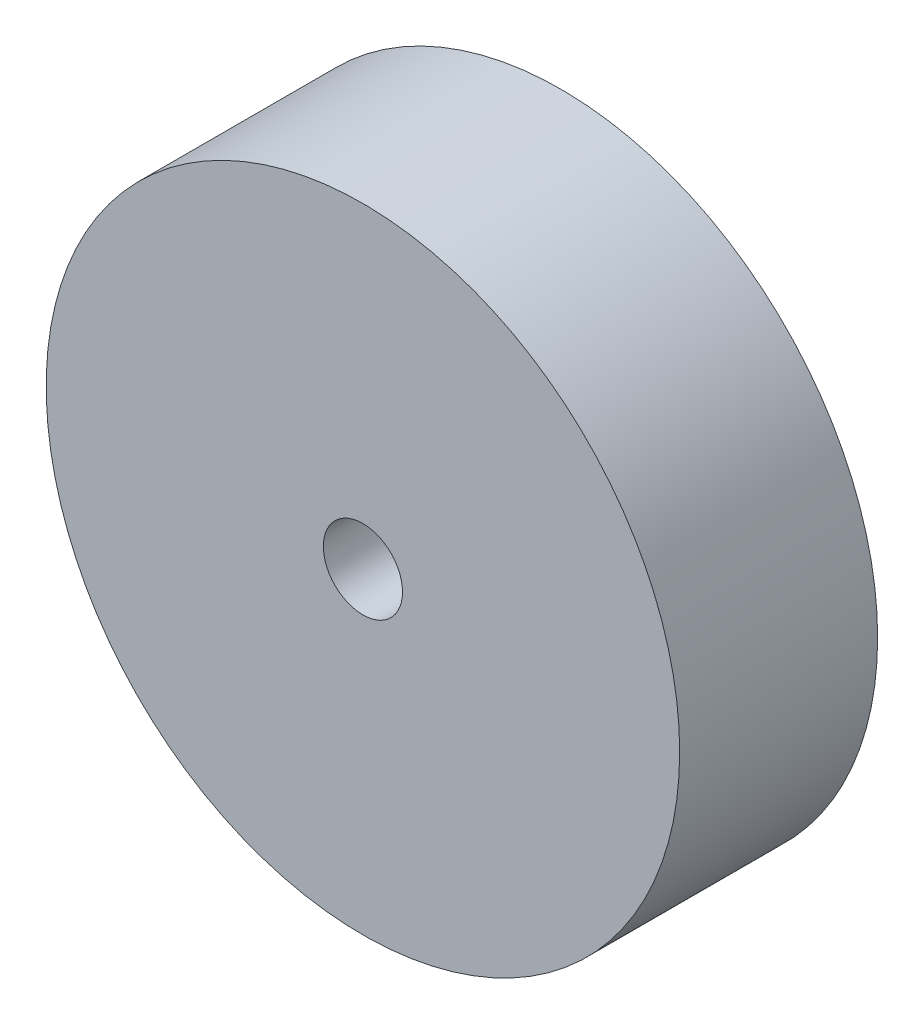
ISO-10303-21;
HEADER;
FILE_DESCRIPTION(('STEP AP214'),'2;1');
FILE_NAME('part.step','',(''),(''),'','','');
FILE_SCHEMA(('AUTOMOTIVE_DESIGN { 1 0 10303 214 1 1 1 1 }'));
ENDSEC;
DATA;
#1=APPLICATION_CONTEXT('core data for automotive mechanical design processes');
#2=APPLICATION_PROTOCOL_DEFINITION('international standard','automotive_design',2000,#1);
#3=PRODUCT_CONTEXT('',#1,'mechanical');
#4=PRODUCT('Part','Part','',(#3));
#5=PRODUCT_RELATED_PRODUCT_CATEGORY('part','',(#4));
#6=PRODUCT_DEFINITION_FORMATION('','',#4);
#7=PRODUCT_DEFINITION_CONTEXT('part definition',#1,'design');
#8=PRODUCT_DEFINITION('design','',#6,#7);
#9=PRODUCT_DEFINITION_SHAPE('','',#8);
#10=(LENGTH_UNIT() NAMED_UNIT(*) SI_UNIT(.MILLI.,.METRE.));
#11=(NAMED_UNIT(*) PLANE_ANGLE_UNIT() SI_UNIT($,.RADIAN.));
#12=(NAMED_UNIT(*) SI_UNIT($,.STERADIAN.) SOLID_ANGLE_UNIT());
#13=UNCERTAINTY_MEASURE_WITH_UNIT(LENGTH_MEASURE(1.E-05),#10,'distance_accuracy_value','');
#14=(GEOMETRIC_REPRESENTATION_CONTEXT(3) GLOBAL_UNCERTAINTY_ASSIGNED_CONTEXT((#13)) GLOBAL_UNIT_ASSIGNED_CONTEXT((#10,
#11,#12)) REPRESENTATION_CONTEXT('',''));
#15=CARTESIAN_POINT('',(0.,0.,0.));
#16=DIRECTION('',(0.,0.,1.));
#17=DIRECTION('',(1.,0.,0.));
#18=AXIS2_PLACEMENT_3D('',#15,#16,#17);
#19=CARTESIAN_POINT('',(0.,0.,31.75));
#20=DIRECTION('',(0.,0.,1.));
#21=DIRECTION('',(1.,0.,0.));
#22=AXIS2_PLACEMENT_3D('',#19,#20,#21);
#23=PLANE('',#22);
#24=CARTESIAN_POINT('',(0.,0.,31.75));
#25=DIRECTION('',(0.,0.,1.));
#26=DIRECTION('',(1.,0.,0.));
#27=AXIS2_PLACEMENT_3D('',#24,#25,#26);
#28=CIRCLE('',#27,50.8);
#29=CARTESIAN_POINT('',(50.8,0.,31.75));
#30=VERTEX_POINT('',#29);
#31=EDGE_CURVE('E10',#30,#30,#28,.T.);
#32=ORIENTED_EDGE('',*,*,#31,.T.);
#33=EDGE_LOOP('',(#32));
#34=FACE_BOUND('',#33,.T.);
#35=CARTESIAN_POINT('',(0.,0.,31.75));
#36=DIRECTION('',(0.,0.,1.));
#37=DIRECTION('',(1.,0.,0.));
#38=AXIS2_PLACEMENT_3D('',#35,#36,#37);
#39=CIRCLE('',#38,6.35);
#40=CARTESIAN_POINT('',(6.35,0.,31.75));
#41=VERTEX_POINT('',#40);
#42=EDGE_CURVE('E42',#41,#41,#39,.T.);
#43=ORIENTED_EDGE('',*,*,#42,.F.);
#44=EDGE_LOOP('',(#43));
#45=FACE_BOUND('',#44,.T.);
#46=ADVANCED_FACE('F31',(#34,#45),#23,.T.);
#47=CARTESIAN_POINT('',(0.,0.,0.));
#48=DIRECTION('',(0.,0.,1.));
#49=DIRECTION('',(1.,0.,0.));
#50=AXIS2_PLACEMENT_3D('',#47,#48,#49);
#51=PLANE('',#50);
#52=CARTESIAN_POINT('',(0.,0.,0.));
#53=DIRECTION('',(0.,0.,1.));
#54=DIRECTION('',(1.,0.,0.));
#55=AXIS2_PLACEMENT_3D('',#52,#53,#54);
#56=CIRCLE('',#55,50.8);
#57=CARTESIAN_POINT('',(50.8,0.,0.));
#58=VERTEX_POINT('',#57);
#59=EDGE_CURVE('E35',#58,#58,#56,.T.);
#60=ORIENTED_EDGE('',*,*,#59,.F.);
#61=EDGE_LOOP('',(#60));
#62=FACE_BOUND('',#61,.T.);
#63=CARTESIAN_POINT('',(0.,0.,0.));
#64=DIRECTION('',(0.,0.,1.));
#65=DIRECTION('',(1.,0.,0.));
#66=AXIS2_PLACEMENT_3D('',#63,#64,#65);
#67=CIRCLE('',#66,6.35);
#68=CARTESIAN_POINT('',(6.35,0.,0.));
#69=VERTEX_POINT('',#68);
#70=EDGE_CURVE('E44',#69,#69,#67,.T.);
#71=ORIENTED_EDGE('',*,*,#70,.T.);
#72=EDGE_LOOP('',(#71));
#73=FACE_BOUND('',#72,.T.);
#74=ADVANCED_FACE('F54',(#62,#73),#51,.F.);
#75=CARTESIAN_POINT('',(0.,0.,31.75));
#76=DIRECTION('',(0.,0.,-1.));
#77=DIRECTION('',(-1.,0.,0.));
#78=AXIS2_PLACEMENT_3D('',#75,#76,#77);
#79=CYLINDRICAL_SURFACE('',#78,50.8);
#80=ORIENTED_EDGE('',*,*,#31,.F.);
#81=EDGE_LOOP('',(#80));
#82=FACE_BOUND('',#81,.T.);
#83=ORIENTED_EDGE('',*,*,#59,.T.);
#84=EDGE_LOOP('',(#83));
#85=FACE_BOUND('',#84,.T.);
#86=ADVANCED_FACE('F33',(#82,#85),#79,.T.);
#87=CARTESIAN_POINT('',(0.,0.,31.75));
#88=DIRECTION('',(0.,0.,-1.));
#89=DIRECTION('',(-1.,0.,0.));
#90=AXIS2_PLACEMENT_3D('',#87,#88,#89);
#91=CYLINDRICAL_SURFACE('',#90,6.35);
#92=ORIENTED_EDGE('',*,*,#42,.T.);
#93=EDGE_LOOP('',(#92));
#94=FACE_BOUND('',#93,.T.);
#95=ORIENTED_EDGE('',*,*,#70,.F.);
#96=EDGE_LOOP('',(#95));
#97=FACE_BOUND('',#96,.T.);
#98=ADVANCED_FACE('F50',(#94,#97),#91,.F.);
#99=CLOSED_SHELL('',(#46,#74,#86,#98));
#100=MANIFOLD_SOLID_BREP('B2',#99);
#101=ADVANCED_BREP_SHAPE_REPRESENTATION('',(#18,#100),#14);
#102=SHAPE_DEFINITION_REPRESENTATION(#9,#101);
ENDSEC;
END-ISO-10303-21;
